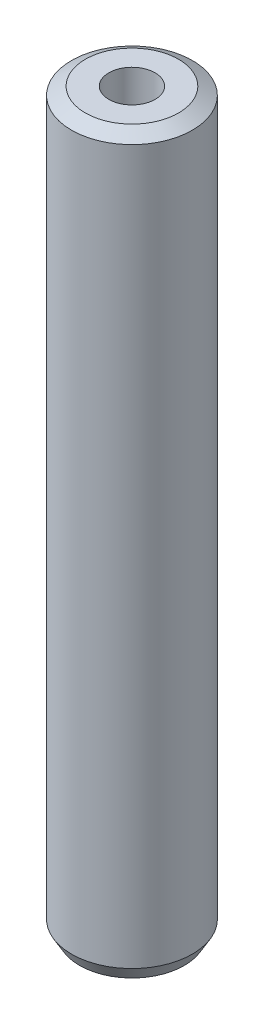
ISO-10303-21;
HEADER;
FILE_DESCRIPTION(('STEP AP214'),'2;1');
FILE_NAME('part.step','',(''),(''),'','','');
FILE_SCHEMA(('AUTOMOTIVE_DESIGN { 1 0 10303 214 1 1 1 1 }'));
ENDSEC;
DATA;
#1=APPLICATION_CONTEXT('core data for automotive mechanical design processes');
#2=APPLICATION_PROTOCOL_DEFINITION('international standard','automotive_design',2000,#1);
#3=PRODUCT_CONTEXT('',#1,'mechanical');
#4=PRODUCT('Part','Part','',(#3));
#5=PRODUCT_RELATED_PRODUCT_CATEGORY('part','',(#4));
#6=PRODUCT_DEFINITION_FORMATION('','',#4);
#7=PRODUCT_DEFINITION_CONTEXT('part definition',#1,'design');
#8=PRODUCT_DEFINITION('design','',#6,#7);
#9=PRODUCT_DEFINITION_SHAPE('','',#8);
#10=(LENGTH_UNIT() NAMED_UNIT(*) SI_UNIT(.MILLI.,.METRE.));
#11=(NAMED_UNIT(*) PLANE_ANGLE_UNIT() SI_UNIT($,.RADIAN.));
#12=(NAMED_UNIT(*) SI_UNIT($,.STERADIAN.) SOLID_ANGLE_UNIT());
#13=UNCERTAINTY_MEASURE_WITH_UNIT(LENGTH_MEASURE(1.E-05),#10,'distance_accuracy_value','');
#14=(GEOMETRIC_REPRESENTATION_CONTEXT(3) GLOBAL_UNCERTAINTY_ASSIGNED_CONTEXT((#13)) GLOBAL_UNIT_ASSIGNED_CONTEXT((#10,
#11,#12)) REPRESENTATION_CONTEXT('',''));
#15=CARTESIAN_POINT('',(0.,0.,0.));
#16=DIRECTION('',(0.,0.,1.));
#17=DIRECTION('',(1.,0.,0.));
#18=AXIS2_PLACEMENT_3D('',#15,#16,#17);
#19=CARTESIAN_POINT('',(0.,152.135248105009,0.));
#20=DIRECTION('',(0.,-1.,0.));
#21=DIRECTION('',(0.,0.,-1.));
#22=AXIS2_PLACEMENT_3D('',#19,#20,#21);
#23=CYLINDRICAL_SURFACE('',#22,12.5);
#24=CARTESIAN_POINT('',(0.,150.482614357831,0.));
#25=DIRECTION('',(0.,1.,0.));
#26=DIRECTION('',(0.,0.,1.));
#27=AXIS2_PLACEMENT_3D('',#24,#25,#26);
#28=CIRCLE('',#27,12.5);
#29=CARTESIAN_POINT('',(0.,150.482614357831,12.5));
#30=VERTEX_POINT('',#29);
#31=EDGE_CURVE('E50',#30,#30,#28,.F.);
#32=ORIENTED_EDGE('',*,*,#31,.T.);
#33=EDGE_LOOP('',(#32));
#34=FACE_BOUND('',#33,.T.);
#35=CARTESIAN_POINT('',(0.,2.86244561641547,0.));
#36=DIRECTION('',(0.,1.,0.));
#37=DIRECTION('',(0.,0.,1.));
#38=AXIS2_PLACEMENT_3D('',#35,#36,#37);
#39=CIRCLE('',#38,12.5);
#40=CARTESIAN_POINT('',(0.,2.86244561641547,12.5));
#41=VERTEX_POINT('',#40);
#42=EDGE_CURVE('E51',#41,#41,#39,.T.);
#43=ORIENTED_EDGE('',*,*,#42,.T.);
#44=EDGE_LOOP('',(#43));
#45=FACE_BOUND('',#44,.T.);
#46=ADVANCED_FACE('F39',(#34,#45),#23,.T.);
#47=CARTESIAN_POINT('',(0.,152.135248105009,0.));
#48=DIRECTION('',(0.,1.,0.));
#49=DIRECTION('',(0.,0.,1.));
#50=AXIS2_PLACEMENT_3D('',#47,#48,#49);
#51=PLANE('',#50);
#52=CARTESIAN_POINT('',(0.,152.135248105009,0.));
#53=DIRECTION('',(0.,1.,0.));
#54=DIRECTION('',(0.,0.,1.));
#55=AXIS2_PLACEMENT_3D('',#52,#53,#54);
#56=CIRCLE('',#55,9.63755438358446);
#57=CARTESIAN_POINT('',(0.,152.135248105009,9.63755438358446));
#58=VERTEX_POINT('',#57);
#59=EDGE_CURVE('E54',#58,#58,#56,.T.);
#60=ORIENTED_EDGE('',*,*,#59,.T.);
#61=EDGE_LOOP('',(#60));
#62=FACE_BOUND('',#61,.T.);
#63=CARTESIAN_POINT('',(0.,152.135248105009,0.));
#64=DIRECTION('',(0.,1.,0.));
#65=DIRECTION('',(0.,0.,1.));
#66=AXIS2_PLACEMENT_3D('',#63,#64,#65);
#67=CIRCLE('',#66,4.78005173354303);
#68=CARTESIAN_POINT('',(0.,152.135248105009,4.78005173354303));
#69=VERTEX_POINT('',#68);
#70=EDGE_CURVE('E58',#69,#69,#67,.T.);
#71=ORIENTED_EDGE('',*,*,#70,.F.);
#72=EDGE_LOOP('',(#71));
#73=FACE_BOUND('',#72,.T.);
#74=ADVANCED_FACE('F69',(#62,#73),#51,.T.);
#75=CARTESIAN_POINT('',(0.,0.,0.));
#76=DIRECTION('',(0.,1.,0.));
#77=DIRECTION('',(0.,0.,1.));
#78=AXIS2_PLACEMENT_3D('',#75,#76,#77);
#79=PLANE('',#78);
#80=CARTESIAN_POINT('',(0.,0.,0.));
#81=DIRECTION('',(0.,1.,0.));
#82=DIRECTION('',(0.,0.,1.));
#83=AXIS2_PLACEMENT_3D('',#80,#81,#82);
#84=CIRCLE('',#83,10.8473662528218);
#85=CARTESIAN_POINT('',(0.,0.,10.8473662528218));
#86=VERTEX_POINT('',#85);
#87=EDGE_CURVE('E10',#86,#86,#84,.F.);
#88=ORIENTED_EDGE('',*,*,#87,.T.);
#89=EDGE_LOOP('',(#88));
#90=FACE_BOUND('',#89,.T.);
#91=CARTESIAN_POINT('',(0.,0.,0.));
#92=DIRECTION('',(0.,1.,0.));
#93=DIRECTION('',(0.,0.,1.));
#94=AXIS2_PLACEMENT_3D('',#91,#92,#93);
#95=CIRCLE('',#94,4.78005173354303);
#96=CARTESIAN_POINT('',(0.,0.,4.78005173354303));
#97=VERTEX_POINT('',#96);
#98=EDGE_CURVE('E63',#97,#97,#95,.T.);
#99=ORIENTED_EDGE('',*,*,#98,.T.);
#100=EDGE_LOOP('',(#99));
#101=FACE_BOUND('',#100,.T.);
#102=ADVANCED_FACE('F75',(#90,#101),#79,.F.);
#103=CARTESIAN_POINT('',(0.,152.135248105009,0.));
#104=DIRECTION('',(0.,-1.,0.));
#105=DIRECTION('',(0.,0.,-1.));
#106=AXIS2_PLACEMENT_3D('',#103,#104,#105);
#107=CYLINDRICAL_SURFACE('',#106,4.78005173354303);
#108=ORIENTED_EDGE('',*,*,#70,.T.);
#109=EDGE_LOOP('',(#108));
#110=FACE_BOUND('',#109,.T.);
#111=ORIENTED_EDGE('',*,*,#98,.F.);
#112=EDGE_LOOP('',(#111));
#113=FACE_BOUND('',#112,.T.);
#114=ADVANCED_FACE('F70',(#110,#113),#107,.F.);
#115=CARTESIAN_POINT('',(0.,152.135248105009,0.));
#116=DIRECTION('',(0.,-1.,0.));
#117=DIRECTION('',(0.,0.,-1.));
#118=AXIS2_PLACEMENT_3D('',#115,#116,#117);
#119=CONICAL_SURFACE('',#118,9.63755438358446,1.04719755119659);
#120=ORIENTED_EDGE('',*,*,#31,.F.);
#121=EDGE_LOOP('',(#120));
#122=FACE_BOUND('',#121,.T.);
#123=ORIENTED_EDGE('',*,*,#59,.F.);
#124=EDGE_LOOP('',(#123));
#125=FACE_BOUND('',#124,.T.);
#126=ADVANCED_FACE('F81',(#122,#125),#119,.T.);
#127=CARTESIAN_POINT('',(0.,2.86244561641547,0.));
#128=DIRECTION('',(0.,1.,0.));
#129=DIRECTION('',(0.,0.,1.));
#130=AXIS2_PLACEMENT_3D('',#127,#128,#129);
#131=CONICAL_SURFACE('',#130,12.5,0.523598775598305);
#132=ORIENTED_EDGE('',*,*,#87,.F.);
#133=EDGE_LOOP('',(#132));
#134=FACE_BOUND('',#133,.T.);
#135=ORIENTED_EDGE('',*,*,#42,.F.);
#136=EDGE_LOOP('',(#135));
#137=FACE_BOUND('',#136,.T.);
#138=ADVANCED_FACE('F45',(#134,#137),#131,.T.);
#139=CLOSED_SHELL('',(#46,#74,#102,#114,#126,#138));
#140=MANIFOLD_SOLID_BREP('B2',#139);
#141=ADVANCED_BREP_SHAPE_REPRESENTATION('',(#18,#140),#14);
#142=SHAPE_DEFINITION_REPRESENTATION(#9,#141);
ENDSEC;
END-ISO-10303-21;
